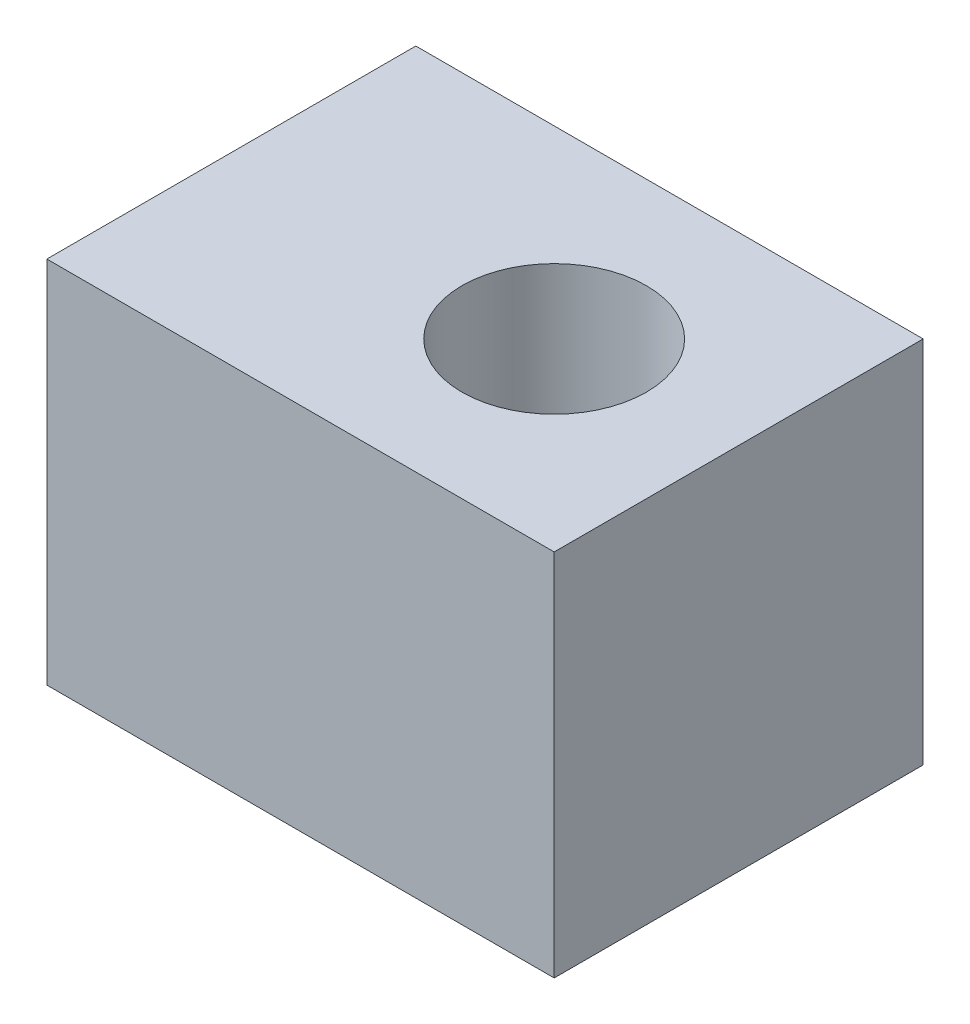
ISO-10303-21;
HEADER;
FILE_DESCRIPTION(('STEP AP214'),'2;1');
FILE_NAME('part.step','',(''),(''),'','','');
FILE_SCHEMA(('AUTOMOTIVE_DESIGN { 1 0 10303 214 1 1 1 1 }'));
ENDSEC;
DATA;
#1=APPLICATION_CONTEXT('core data for automotive mechanical design processes');
#2=APPLICATION_PROTOCOL_DEFINITION('international standard','automotive_design',2000,#1);
#3=PRODUCT_CONTEXT('',#1,'mechanical');
#4=PRODUCT('Part','Part','',(#3));
#5=PRODUCT_RELATED_PRODUCT_CATEGORY('part','',(#4));
#6=PRODUCT_DEFINITION_FORMATION('','',#4);
#7=PRODUCT_DEFINITION_CONTEXT('part definition',#1,'design');
#8=PRODUCT_DEFINITION('design','',#6,#7);
#9=PRODUCT_DEFINITION_SHAPE('','',#8);
#10=(LENGTH_UNIT() NAMED_UNIT(*) SI_UNIT(.MILLI.,.METRE.));
#11=(NAMED_UNIT(*) PLANE_ANGLE_UNIT() SI_UNIT($,.RADIAN.));
#12=(NAMED_UNIT(*) SI_UNIT($,.STERADIAN.) SOLID_ANGLE_UNIT());
#13=UNCERTAINTY_MEASURE_WITH_UNIT(LENGTH_MEASURE(1.E-05),#10,'distance_accuracy_value','');
#14=(GEOMETRIC_REPRESENTATION_CONTEXT(3) GLOBAL_UNCERTAINTY_ASSIGNED_CONTEXT((#13)) GLOBAL_UNIT_ASSIGNED_CONTEXT((#10,
#11,#12)) REPRESENTATION_CONTEXT('',''));
#15=CARTESIAN_POINT('',(0.,0.,0.));
#16=DIRECTION('',(0.,0.,1.));
#17=DIRECTION('',(1.,0.,0.));
#18=AXIS2_PLACEMENT_3D('',#15,#16,#17);
#19=CARTESIAN_POINT('',(0.,0.,16.));
#20=DIRECTION('',(1.,0.,0.));
#21=DIRECTION('',(0.,1.,0.));
#22=AXIS2_PLACEMENT_3D('',#19,#20,#21);
#23=PLANE('',#22);
#24=CARTESIAN_POINT('',(0.,8.,8.));
#25=DIRECTION('',(-1.,0.,0.));
#26=DIRECTION('',(0.,-1.,0.));
#27=AXIS2_PLACEMENT_3D('',#24,#25,#26);
#28=CIRCLE('',#27,4.);
#29=CARTESIAN_POINT('',(0.,4.,8.));
#30=VERTEX_POINT('',#29);
#31=EDGE_CURVE('E109',#30,#30,#28,.T.);
#32=ORIENTED_EDGE('',*,*,#31,.F.);
#33=EDGE_LOOP('',(#32));
#34=FACE_BOUND('',#33,.T.);
#35=DIRECTION('',(0.,-1.,0.));
#36=VECTOR('',#35,1.);
#37=CARTESIAN_POINT('',(0.,0.,0.));
#38=LINE('',#37,#36);
#39=CARTESIAN_POINT('',(0.,16.,0.));
#40=VERTEX_POINT('',#39);
#41=CARTESIAN_POINT('',(0.,0.,0.));
#42=VERTEX_POINT('',#41);
#43=EDGE_CURVE('E95',#40,#42,#38,.T.);
#44=ORIENTED_EDGE('',*,*,#43,.T.);
#45=DIRECTION('',(0.,0.,-1.));
#46=VECTOR('',#45,1.);
#47=CARTESIAN_POINT('',(0.,0.,16.));
#48=LINE('',#47,#46);
#49=CARTESIAN_POINT('',(0.,0.,16.));
#50=VERTEX_POINT('',#49);
#51=EDGE_CURVE('E11',#50,#42,#48,.T.);
#52=ORIENTED_EDGE('',*,*,#51,.F.);
#53=DIRECTION('',(0.,-1.,0.));
#54=VECTOR('',#53,1.);
#55=CARTESIAN_POINT('',(0.,0.,16.));
#56=LINE('',#55,#54);
#57=CARTESIAN_POINT('',(0.,16.,16.));
#58=VERTEX_POINT('',#57);
#59=EDGE_CURVE('E83',#58,#50,#56,.T.);
#60=ORIENTED_EDGE('',*,*,#59,.F.);
#61=DIRECTION('',(0.,0.,-1.));
#62=VECTOR('',#61,1.);
#63=CARTESIAN_POINT('',(0.,16.,16.));
#64=LINE('',#63,#62);
#65=EDGE_CURVE('E91',#58,#40,#64,.T.);
#66=ORIENTED_EDGE('',*,*,#65,.T.);
#67=EDGE_LOOP('',(#44,#52,#60,#66));
#68=FACE_BOUND('',#67,.T.);
#69=ADVANCED_FACE('F32',(#34,#68),#23,.F.);
#70=CARTESIAN_POINT('',(0.,0.,16.));
#71=DIRECTION('',(0.,1.,0.));
#72=DIRECTION('',(0.,0.,1.));
#73=AXIS2_PLACEMENT_3D('',#70,#71,#72);
#74=PLANE('',#73);
#75=CARTESIAN_POINT('',(14.,0.,8.));
#76=DIRECTION('',(0.,-1.,0.));
#77=DIRECTION('',(0.,0.,-1.));
#78=AXIS2_PLACEMENT_3D('',#75,#76,#77);
#79=CIRCLE('',#78,4.);
#80=CARTESIAN_POINT('',(14.,0.,4.));
#81=VERTEX_POINT('',#80);
#82=EDGE_CURVE('E115',#81,#81,#79,.T.);
#83=ORIENTED_EDGE('',*,*,#82,.F.);
#84=EDGE_LOOP('',(#83));
#85=FACE_BOUND('',#84,.T.);
#86=DIRECTION('',(1.,0.,0.));
#87=VECTOR('',#86,1.);
#88=CARTESIAN_POINT('',(0.,0.,0.));
#89=LINE('',#88,#87);
#90=CARTESIAN_POINT('',(22.,0.,0.));
#91=VERTEX_POINT('',#90);
#92=EDGE_CURVE('E87',#42,#91,#89,.T.);
#93=ORIENTED_EDGE('',*,*,#92,.T.);
#94=DIRECTION('',(0.,0.,-1.));
#95=VECTOR('',#94,1.);
#96=CARTESIAN_POINT('',(22.,0.,16.));
#97=LINE('',#96,#95);
#98=CARTESIAN_POINT('',(22.,0.,16.));
#99=VERTEX_POINT('',#98);
#100=EDGE_CURVE('E40',#99,#91,#97,.T.);
#101=ORIENTED_EDGE('',*,*,#100,.F.);
#102=DIRECTION('',(1.,0.,0.));
#103=VECTOR('',#102,1.);
#104=CARTESIAN_POINT('',(0.,0.,16.));
#105=LINE('',#104,#103);
#106=EDGE_CURVE('E78',#50,#99,#105,.T.);
#107=ORIENTED_EDGE('',*,*,#106,.F.);
#108=ORIENTED_EDGE('',*,*,#51,.T.);
#109=EDGE_LOOP('',(#93,#101,#107,#108));
#110=FACE_BOUND('',#109,.T.);
#111=ADVANCED_FACE('F86',(#85,#110),#74,.F.);
#112=CARTESIAN_POINT('',(22.,0.,16.));
#113=DIRECTION('',(-1.,0.,0.));
#114=DIRECTION('',(0.,0.,1.));
#115=AXIS2_PLACEMENT_3D('',#112,#113,#114);
#116=PLANE('',#115);
#117=DIRECTION('',(0.,1.,0.));
#118=VECTOR('',#117,1.);
#119=CARTESIAN_POINT('',(22.,0.,0.));
#120=LINE('',#119,#118);
#121=CARTESIAN_POINT('',(22.,16.,0.));
#122=VERTEX_POINT('',#121);
#123=EDGE_CURVE('E65',#91,#122,#120,.T.);
#124=ORIENTED_EDGE('',*,*,#123,.T.);
#125=DIRECTION('',(0.,0.,-1.));
#126=VECTOR('',#125,1.);
#127=CARTESIAN_POINT('',(22.,16.,16.));
#128=LINE('',#127,#126);
#129=CARTESIAN_POINT('',(22.,16.,16.));
#130=VERTEX_POINT('',#129);
#131=EDGE_CURVE('E88',#130,#122,#128,.T.);
#132=ORIENTED_EDGE('',*,*,#131,.F.);
#133=DIRECTION('',(0.,1.,0.));
#134=VECTOR('',#133,1.);
#135=CARTESIAN_POINT('',(22.,0.,16.));
#136=LINE('',#135,#134);
#137=EDGE_CURVE('E81',#99,#130,#136,.T.);
#138=ORIENTED_EDGE('',*,*,#137,.F.);
#139=ORIENTED_EDGE('',*,*,#100,.T.);
#140=EDGE_LOOP('',(#124,#132,#138,#139));
#141=FACE_BOUND('',#140,.T.);
#142=ADVANCED_FACE('F89',(#141),#116,.F.);
#143=CARTESIAN_POINT('',(0.,16.,16.));
#144=DIRECTION('',(0.,-1.,0.));
#145=DIRECTION('',(1.,0.,0.));
#146=AXIS2_PLACEMENT_3D('',#143,#144,#145);
#147=PLANE('',#146);
#148=CARTESIAN_POINT('',(14.,16.,8.));
#149=DIRECTION('',(0.,-1.,0.));
#150=DIRECTION('',(0.,0.,-1.));
#151=AXIS2_PLACEMENT_3D('',#148,#149,#150);
#152=CIRCLE('',#151,4.);
#153=CARTESIAN_POINT('',(14.,16.,4.));
#154=VERTEX_POINT('',#153);
#155=EDGE_CURVE('E112',#154,#154,#152,.T.);
#156=ORIENTED_EDGE('',*,*,#155,.T.);
#157=EDGE_LOOP('',(#156));
#158=FACE_BOUND('',#157,.T.);
#159=DIRECTION('',(-1.,0.,0.));
#160=VECTOR('',#159,1.);
#161=CARTESIAN_POINT('',(0.,16.,0.));
#162=LINE('',#161,#160);
#163=EDGE_CURVE('E71',#122,#40,#162,.T.);
#164=ORIENTED_EDGE('',*,*,#163,.T.);
#165=ORIENTED_EDGE('',*,*,#65,.F.);
#166=DIRECTION('',(-1.,0.,0.));
#167=VECTOR('',#166,1.);
#168=CARTESIAN_POINT('',(0.,16.,16.));
#169=LINE('',#168,#167);
#170=EDGE_CURVE('E48',#130,#58,#169,.T.);
#171=ORIENTED_EDGE('',*,*,#170,.F.);
#172=ORIENTED_EDGE('',*,*,#131,.T.);
#173=EDGE_LOOP('',(#164,#165,#171,#172));
#174=FACE_BOUND('',#173,.T.);
#175=ADVANCED_FACE('F103',(#158,#174),#147,.F.);
#176=CARTESIAN_POINT('',(0.,16.,16.));
#177=DIRECTION('',(0.,0.,-1.));
#178=DIRECTION('',(-1.,0.,0.));
#179=AXIS2_PLACEMENT_3D('',#176,#177,#178);
#180=PLANE('',#179);
#181=ORIENTED_EDGE('',*,*,#59,.T.);
#182=ORIENTED_EDGE('',*,*,#106,.T.);
#183=ORIENTED_EDGE('',*,*,#137,.T.);
#184=ORIENTED_EDGE('',*,*,#170,.T.);
#185=EDGE_LOOP('',(#181,#182,#183,#184));
#186=FACE_BOUND('',#185,.T.);
#187=ADVANCED_FACE('F79',(#186),#180,.F.);
#188=CARTESIAN_POINT('',(0.,16.,0.));
#189=DIRECTION('',(0.,0.,-1.));
#190=DIRECTION('',(-1.,0.,0.));
#191=AXIS2_PLACEMENT_3D('',#188,#189,#190);
#192=PLANE('',#191);
#193=ORIENTED_EDGE('',*,*,#43,.F.);
#194=ORIENTED_EDGE('',*,*,#163,.F.);
#195=ORIENTED_EDGE('',*,*,#123,.F.);
#196=ORIENTED_EDGE('',*,*,#92,.F.);
#197=EDGE_LOOP('',(#193,#194,#195,#196));
#198=FACE_BOUND('',#197,.T.);
#199=ADVANCED_FACE('F106',(#198),#192,.T.);
#200=CARTESIAN_POINT('',(8.,8.,8.));
#201=DIRECTION('',(-1.,0.,0.));
#202=DIRECTION('',(0.,-1.,0.));
#203=AXIS2_PLACEMENT_3D('',#200,#201,#202);
#204=CYLINDRICAL_SURFACE('',#203,4.);
#205=CARTESIAN_POINT('',(8.,8.,8.));
#206=DIRECTION('',(-1.,0.,0.));
#207=DIRECTION('',(0.,-1.,0.));
#208=AXIS2_PLACEMENT_3D('',#205,#206,#207);
#209=CIRCLE('',#208,4.);
#210=CARTESIAN_POINT('',(8.,4.,8.));
#211=VERTEX_POINT('',#210);
#212=EDGE_CURVE('E98',#211,#211,#209,.T.);
#213=ORIENTED_EDGE('',*,*,#212,.F.);
#214=EDGE_LOOP('',(#213));
#215=FACE_BOUND('',#214,.T.);
#216=ORIENTED_EDGE('',*,*,#31,.T.);
#217=EDGE_LOOP('',(#216));
#218=FACE_BOUND('',#217,.T.);
#219=ADVANCED_FACE('F141',(#215,#218),#204,.F.);
#220=CARTESIAN_POINT('',(8.,8.,8.));
#221=DIRECTION('',(-1.,0.,0.));
#222=DIRECTION('',(0.,-1.,0.));
#223=AXIS2_PLACEMENT_3D('',#220,#221,#222);
#224=PLANE('',#223);
#225=ORIENTED_EDGE('',*,*,#212,.T.);
#226=EDGE_LOOP('',(#225));
#227=FACE_BOUND('',#226,.T.);
#228=ADVANCED_FACE('F125',(#227),#224,.T.);
#229=CARTESIAN_POINT('',(14.,16.,8.));
#230=DIRECTION('',(0.,-1.,0.));
#231=DIRECTION('',(0.,0.,-1.));
#232=AXIS2_PLACEMENT_3D('',#229,#230,#231);
#233=CYLINDRICAL_SURFACE('',#232,4.);
#234=ORIENTED_EDGE('',*,*,#155,.F.);
#235=EDGE_LOOP('',(#234));
#236=FACE_BOUND('',#235,.T.);
#237=ORIENTED_EDGE('',*,*,#82,.T.);
#238=EDGE_LOOP('',(#237));
#239=FACE_BOUND('',#238,.T.);
#240=ADVANCED_FACE('F122',(#236,#239),#233,.F.);
#241=CLOSED_SHELL('',(#69,#111,#142,#175,#187,#199,#219,#228,#240));
#242=MANIFOLD_SOLID_BREP('B2',#241);
#243=ADVANCED_BREP_SHAPE_REPRESENTATION('',(#18,#242),#14);
#244=SHAPE_DEFINITION_REPRESENTATION(#9,#243);
ENDSEC;
END-ISO-10303-21;
